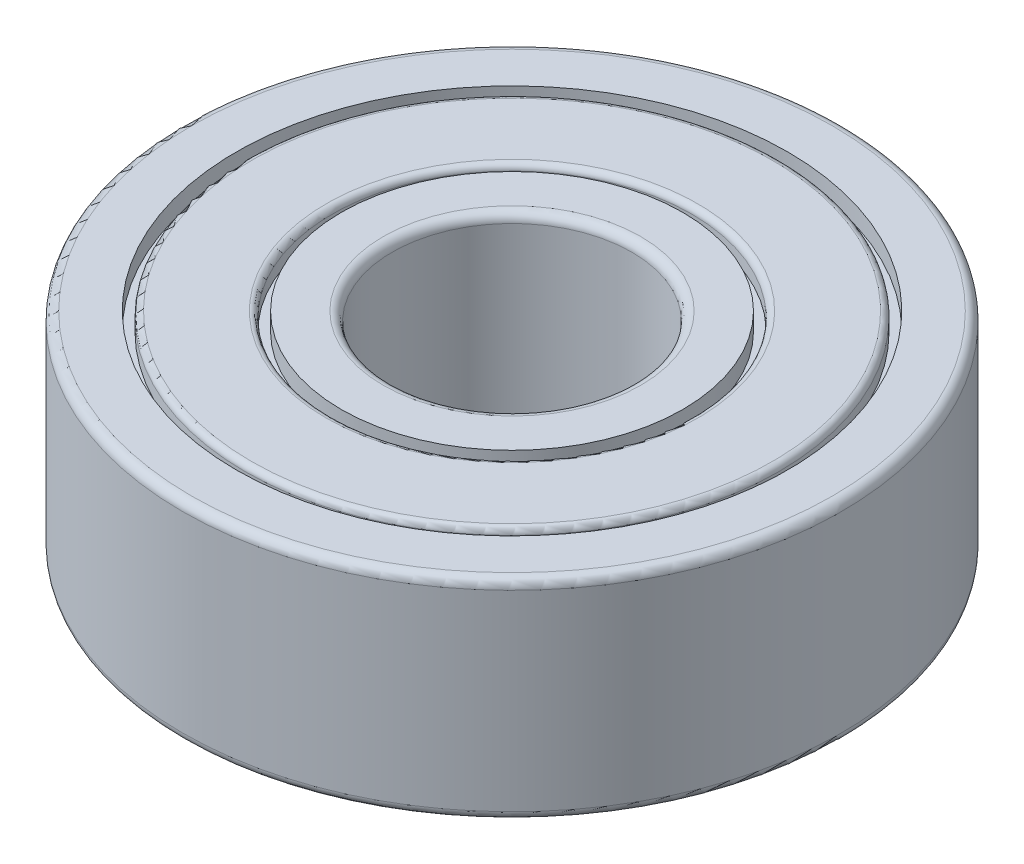
ISO-10303-21;
HEADER;
FILE_DESCRIPTION(('STEP AP214'),'2;1');
FILE_NAME('part.step','',(''),(''),'','','');
FILE_SCHEMA(('AUTOMOTIVE_DESIGN { 1 0 10303 214 1 1 1 1 }'));
ENDSEC;
DATA;
#1=APPLICATION_CONTEXT('core data for automotive mechanical design processes');
#2=APPLICATION_PROTOCOL_DEFINITION('international standard','automotive_design',2000,#1);
#3=PRODUCT_CONTEXT('',#1,'mechanical');
#4=PRODUCT('Part','Part','',(#3));
#5=PRODUCT_RELATED_PRODUCT_CATEGORY('part','',(#4));
#6=PRODUCT_DEFINITION_FORMATION('','',#4);
#7=PRODUCT_DEFINITION_CONTEXT('part definition',#1,'design');
#8=PRODUCT_DEFINITION('design','',#6,#7);
#9=PRODUCT_DEFINITION_SHAPE('','',#8);
#10=(LENGTH_UNIT() NAMED_UNIT(*) SI_UNIT(.MILLI.,.METRE.));
#11=(NAMED_UNIT(*) PLANE_ANGLE_UNIT() SI_UNIT($,.RADIAN.));
#12=(NAMED_UNIT(*) SI_UNIT($,.STERADIAN.) SOLID_ANGLE_UNIT());
#13=UNCERTAINTY_MEASURE_WITH_UNIT(LENGTH_MEASURE(1.E-05),#10,'distance_accuracy_value','');
#14=(GEOMETRIC_REPRESENTATION_CONTEXT(3) GLOBAL_UNCERTAINTY_ASSIGNED_CONTEXT((#13)) GLOBAL_UNIT_ASSIGNED_CONTEXT((#10,
#11,#12)) REPRESENTATION_CONTEXT('',''));
#15=CARTESIAN_POINT('',(0.,0.,0.));
#16=DIRECTION('',(0.,0.,1.));
#17=DIRECTION('',(1.,0.,0.));
#18=AXIS2_PLACEMENT_3D('',#15,#16,#17);
#19=CARTESIAN_POINT('',(0.,3.2,0.));
#20=DIRECTION('',(0.,-1.,0.));
#21=DIRECTION('',(0.,0.,-1.));
#22=AXIS2_PLACEMENT_3D('',#19,#20,#21);
#23=CYLINDRICAL_SURFACE('',#22,4.);
#24=CARTESIAN_POINT('',(0.,-3.2,0.));
#25=DIRECTION('',(0.,-1.,0.));
#26=DIRECTION('',(0.,0.,1.));
#27=AXIS2_PLACEMENT_3D('',#24,#25,#26);
#28=CIRCLE('',#27,4.);
#29=CARTESIAN_POINT('',(0.,-3.2,4.));
#30=VERTEX_POINT('',#29);
#31=EDGE_CURVE('E274',#30,#30,#28,.F.);
#32=ORIENTED_EDGE('',*,*,#31,.F.);
#33=EDGE_LOOP('',(#32));
#34=FACE_BOUND('',#33,.T.);
#35=CARTESIAN_POINT('',(0.,3.2,0.));
#36=DIRECTION('',(0.,-1.,0.));
#37=DIRECTION('',(0.,0.,1.));
#38=AXIS2_PLACEMENT_3D('',#35,#36,#37);
#39=CIRCLE('',#38,4.);
#40=CARTESIAN_POINT('',(0.,3.2,4.));
#41=VERTEX_POINT('',#40);
#42=EDGE_CURVE('E278',#41,#41,#39,.F.);
#43=ORIENTED_EDGE('',*,*,#42,.T.);
#44=EDGE_LOOP('',(#43));
#45=FACE_BOUND('',#44,.T.);
#46=ADVANCED_FACE('F14',(#34,#45),#23,.F.);
#47=CARTESIAN_POINT('',(0.,3.2,0.));
#48=DIRECTION('',(0.,-1.,0.));
#49=DIRECTION('',(0.,0.,1.));
#50=AXIS2_PLACEMENT_3D('',#47,#48,#49);
#51=TOROIDAL_SURFACE('',#50,4.3,0.3);
#52=ORIENTED_EDGE('',*,*,#42,.F.);
#53=EDGE_LOOP('',(#52));
#54=FACE_BOUND('',#53,.T.);
#55=CARTESIAN_POINT('',(0.,3.5,0.));
#56=DIRECTION('',(0.,1.,0.));
#57=DIRECTION('',(0.,0.,1.));
#58=AXIS2_PLACEMENT_3D('',#55,#56,#57);
#59=CIRCLE('',#58,4.3);
#60=CARTESIAN_POINT('',(0.,3.5,4.3));
#61=VERTEX_POINT('',#60);
#62=EDGE_CURVE('E277',#61,#61,#59,.F.);
#63=ORIENTED_EDGE('',*,*,#62,.F.);
#64=EDGE_LOOP('',(#63));
#65=FACE_BOUND('',#64,.T.);
#66=ADVANCED_FACE('F292',(#54,#65),#51,.T.);
#67=CARTESIAN_POINT('',(0.,-3.20000000000001,0.));
#68=DIRECTION('',(0.,-1.,0.));
#69=DIRECTION('',(0.,0.,1.));
#70=AXIS2_PLACEMENT_3D('',#67,#68,#69);
#71=TOROIDAL_SURFACE('',#70,4.3,0.3);
#72=CARTESIAN_POINT('',(0.,-3.5,0.));
#73=DIRECTION('',(0.,-1.,0.));
#74=DIRECTION('',(0.,0.,1.));
#75=AXIS2_PLACEMENT_3D('',#72,#73,#74);
#76=CIRCLE('',#75,4.3);
#77=CARTESIAN_POINT('',(0.,-3.5,4.3));
#78=VERTEX_POINT('',#77);
#79=EDGE_CURVE('E238',#78,#78,#76,.F.);
#80=ORIENTED_EDGE('',*,*,#79,.F.);
#81=EDGE_LOOP('',(#80));
#82=FACE_BOUND('',#81,.T.);
#83=ORIENTED_EDGE('',*,*,#31,.T.);
#84=EDGE_LOOP('',(#83));
#85=FACE_BOUND('',#84,.T.);
#86=ADVANCED_FACE('F261',(#82,#85),#71,.T.);
#87=CARTESIAN_POINT('',(0.,3.5,0.));
#88=DIRECTION('',(0.,1.,0.));
#89=DIRECTION('',(0.,0.,1.));
#90=AXIS2_PLACEMENT_3D('',#87,#88,#89);
#91=PLANE('',#90);
#92=ORIENTED_EDGE('',*,*,#62,.T.);
#93=EDGE_LOOP('',(#92));
#94=FACE_BOUND('',#93,.T.);
#95=CARTESIAN_POINT('',(0.,3.5,0.));
#96=DIRECTION('',(0.,1.,0.));
#97=DIRECTION('',(0.,0.,1.));
#98=AXIS2_PLACEMENT_3D('',#95,#96,#97);
#99=CIRCLE('',#98,5.7);
#100=CARTESIAN_POINT('',(0.,3.5,5.7));
#101=VERTEX_POINT('',#100);
#102=EDGE_CURVE('E17',#101,#101,#99,.F.);
#103=ORIENTED_EDGE('',*,*,#102,.F.);
#104=EDGE_LOOP('',(#103));
#105=FACE_BOUND('',#104,.T.);
#106=ADVANCED_FACE('F256',(#94,#105),#91,.T.);
#107=CARTESIAN_POINT('',(0.,-3.5,0.));
#108=DIRECTION('',(0.,-1.,0.));
#109=DIRECTION('',(0.,0.,-1.));
#110=AXIS2_PLACEMENT_3D('',#107,#108,#109);
#111=PLANE('',#110);
#112=ORIENTED_EDGE('',*,*,#79,.T.);
#113=EDGE_LOOP('',(#112));
#114=FACE_BOUND('',#113,.T.);
#115=CARTESIAN_POINT('',(0.,-3.50000000000001,0.));
#116=DIRECTION('',(0.,-1.,0.));
#117=DIRECTION('',(0.,0.,-1.));
#118=AXIS2_PLACEMENT_3D('',#115,#116,#117);
#119=CIRCLE('',#118,5.7);
#120=CARTESIAN_POINT('',(0.,-3.50000000000001,-5.7));
#121=VERTEX_POINT('',#120);
#122=EDGE_CURVE('E335',#121,#121,#119,.F.);
#123=ORIENTED_EDGE('',*,*,#122,.F.);
#124=EDGE_LOOP('',(#123));
#125=FACE_BOUND('',#124,.T.);
#126=ADVANCED_FACE('F245',(#114,#125),#111,.T.);
#127=CARTESIAN_POINT('',(0.,2.9,0.));
#128=DIRECTION('',(0.,1.,0.));
#129=DIRECTION('',(0.,0.,1.));
#130=AXIS2_PLACEMENT_3D('',#127,#128,#129);
#131=CYLINDRICAL_SURFACE('',#130,5.7);
#132=CARTESIAN_POINT('',(0.,2.9,0.));
#133=DIRECTION('',(0.,1.,0.));
#134=DIRECTION('',(0.,0.,1.));
#135=AXIS2_PLACEMENT_3D('',#132,#133,#134);
#136=CIRCLE('',#135,5.7);
#137=CARTESIAN_POINT('',(0.,2.9,5.7));
#138=VERTEX_POINT('',#137);
#139=EDGE_CURVE('E333',#138,#138,#136,.F.);
#140=ORIENTED_EDGE('',*,*,#139,.F.);
#141=EDGE_LOOP('',(#140));
#142=FACE_BOUND('',#141,.T.);
#143=ORIENTED_EDGE('',*,*,#102,.T.);
#144=EDGE_LOOP('',(#143));
#145=FACE_BOUND('',#144,.T.);
#146=ADVANCED_FACE('F255',(#142,#145),#131,.T.);
#147=CARTESIAN_POINT('',(0.,-2.9,0.));
#148=DIRECTION('',(0.,-1.,0.));
#149=DIRECTION('',(0.,0.,-1.));
#150=AXIS2_PLACEMENT_3D('',#147,#148,#149);
#151=CYLINDRICAL_SURFACE('',#150,5.7);
#152=ORIENTED_EDGE('',*,*,#122,.T.);
#153=EDGE_LOOP('',(#152));
#154=FACE_BOUND('',#153,.T.);
#155=CARTESIAN_POINT('',(0.,-2.90000000000001,0.));
#156=DIRECTION('',(0.,-1.,0.));
#157=DIRECTION('',(0.,0.,-1.));
#158=AXIS2_PLACEMENT_3D('',#155,#156,#157);
#159=CIRCLE('',#158,5.7);
#160=CARTESIAN_POINT('',(0.,-2.90000000000001,-5.7));
#161=VERTEX_POINT('',#160);
#162=EDGE_CURVE('E330',#161,#161,#159,.F.);
#163=ORIENTED_EDGE('',*,*,#162,.F.);
#164=EDGE_LOOP('',(#163));
#165=FACE_BOUND('',#164,.T.);
#166=ADVANCED_FACE('F345',(#154,#165),#151,.T.);
#167=CARTESIAN_POINT('',(0.,2.9,0.));
#168=DIRECTION('',(0.,1.,0.));
#169=DIRECTION('',(0.,0.,1.));
#170=AXIS2_PLACEMENT_3D('',#167,#168,#169);
#171=PLANE('',#170);
#172=ORIENTED_EDGE('',*,*,#139,.T.);
#173=EDGE_LOOP('',(#172));
#174=FACE_BOUND('',#173,.T.);
#175=CARTESIAN_POINT('',(0.,2.9,0.));
#176=DIRECTION('',(0.,-1.,0.));
#177=DIRECTION('',(0.,0.,-1.));
#178=AXIS2_PLACEMENT_3D('',#175,#176,#177);
#179=CIRCLE('',#178,6.);
#180=CARTESIAN_POINT('',(0.,2.89999999999999,-6.));
#181=VERTEX_POINT('',#180);
#182=EDGE_CURVE('E327',#181,#181,#179,.F.);
#183=ORIENTED_EDGE('',*,*,#182,.T.);
#184=EDGE_LOOP('',(#183));
#185=FACE_BOUND('',#184,.T.);
#186=ADVANCED_FACE('F351',(#174,#185),#171,.T.);
#187=CARTESIAN_POINT('',(0.,-2.9,0.));
#188=DIRECTION('',(0.,-1.,0.));
#189=DIRECTION('',(0.,0.,-1.));
#190=AXIS2_PLACEMENT_3D('',#187,#188,#189);
#191=PLANE('',#190);
#192=ORIENTED_EDGE('',*,*,#162,.T.);
#193=EDGE_LOOP('',(#192));
#194=FACE_BOUND('',#193,.T.);
#195=CARTESIAN_POINT('',(0.,-2.90000000000001,0.));
#196=DIRECTION('',(0.,1.,0.));
#197=DIRECTION('',(0.,0.,1.));
#198=AXIS2_PLACEMENT_3D('',#195,#196,#197);
#199=CIRCLE('',#198,6.);
#200=CARTESIAN_POINT('',(0.,-2.9,6.));
#201=VERTEX_POINT('',#200);
#202=EDGE_CURVE('E223',#201,#201,#199,.F.);
#203=ORIENTED_EDGE('',*,*,#202,.T.);
#204=EDGE_LOOP('',(#203));
#205=FACE_BOUND('',#204,.T.);
#206=ADVANCED_FACE('F451',(#194,#205),#191,.T.);
#207=CARTESIAN_POINT('',(0.,3.3,0.));
#208=DIRECTION('',(0.,-1.,0.));
#209=DIRECTION('',(0.,0.,-1.));
#210=AXIS2_PLACEMENT_3D('',#207,#208,#209);
#211=CYLINDRICAL_SURFACE('',#210,6.);
#212=CARTESIAN_POINT('',(0.,3.3,0.));
#213=DIRECTION('',(0.,-1.,0.));
#214=DIRECTION('',(0.,0.,1.));
#215=AXIS2_PLACEMENT_3D('',#212,#213,#214);
#216=CIRCLE('',#215,6.);
#217=CARTESIAN_POINT('',(0.,3.3,6.));
#218=VERTEX_POINT('',#217);
#219=EDGE_CURVE('E220',#218,#218,#216,.F.);
#220=ORIENTED_EDGE('',*,*,#219,.T.);
#221=EDGE_LOOP('',(#220));
#222=FACE_BOUND('',#221,.T.);
#223=ORIENTED_EDGE('',*,*,#182,.F.);
#224=EDGE_LOOP('',(#223));
#225=FACE_BOUND('',#224,.T.);
#226=ADVANCED_FACE('F444',(#222,#225),#211,.F.);
#227=CARTESIAN_POINT('',(0.,-3.3,0.));
#228=DIRECTION('',(0.,1.,0.));
#229=DIRECTION('',(0.,0.,1.));
#230=AXIS2_PLACEMENT_3D('',#227,#228,#229);
#231=CYLINDRICAL_SURFACE('',#230,6.);
#232=ORIENTED_EDGE('',*,*,#202,.F.);
#233=EDGE_LOOP('',(#232));
#234=FACE_BOUND('',#233,.T.);
#235=CARTESIAN_POINT('',(0.,-3.30000000000001,0.));
#236=DIRECTION('',(0.,-1.,0.));
#237=DIRECTION('',(0.,0.,1.));
#238=AXIS2_PLACEMENT_3D('',#235,#236,#237);
#239=CIRCLE('',#238,6.);
#240=CARTESIAN_POINT('',(0.,-3.3,6.));
#241=VERTEX_POINT('',#240);
#242=EDGE_CURVE('E198',#241,#241,#239,.F.);
#243=ORIENTED_EDGE('',*,*,#242,.F.);
#244=EDGE_LOOP('',(#243));
#245=FACE_BOUND('',#244,.T.);
#246=ADVANCED_FACE('F437',(#234,#245),#231,.F.);
#247=CARTESIAN_POINT('',(0.,3.3,0.));
#248=DIRECTION('',(0.,-1.,0.));
#249=DIRECTION('',(0.,0.,1.));
#250=AXIS2_PLACEMENT_3D('',#247,#248,#249);
#251=TOROIDAL_SURFACE('',#250,6.2,0.2);
#252=ORIENTED_EDGE('',*,*,#219,.F.);
#253=EDGE_LOOP('',(#252));
#254=FACE_BOUND('',#253,.T.);
#255=CARTESIAN_POINT('',(0.,3.5,0.));
#256=DIRECTION('',(0.,1.,0.));
#257=DIRECTION('',(0.,0.,1.));
#258=AXIS2_PLACEMENT_3D('',#255,#256,#257);
#259=CIRCLE('',#258,6.2);
#260=CARTESIAN_POINT('',(0.,3.5,6.2));
#261=VERTEX_POINT('',#260);
#262=EDGE_CURVE('E177',#261,#261,#259,.F.);
#263=ORIENTED_EDGE('',*,*,#262,.F.);
#264=EDGE_LOOP('',(#263));
#265=FACE_BOUND('',#264,.T.);
#266=ADVANCED_FACE('F204',(#254,#265),#251,.T.);
#267=CARTESIAN_POINT('',(0.,-3.30000000000001,0.));
#268=DIRECTION('',(0.,-1.,0.));
#269=DIRECTION('',(0.,0.,1.));
#270=AXIS2_PLACEMENT_3D('',#267,#268,#269);
#271=TOROIDAL_SURFACE('',#270,6.2,0.2);
#272=CARTESIAN_POINT('',(0.,-3.50000000000001,0.));
#273=DIRECTION('',(0.,-1.,0.));
#274=DIRECTION('',(0.,0.,1.));
#275=AXIS2_PLACEMENT_3D('',#272,#273,#274);
#276=CIRCLE('',#275,6.2);
#277=CARTESIAN_POINT('',(0.,-3.5,6.2));
#278=VERTEX_POINT('',#277);
#279=EDGE_CURVE('E582',#278,#278,#276,.F.);
#280=ORIENTED_EDGE('',*,*,#279,.F.);
#281=EDGE_LOOP('',(#280));
#282=FACE_BOUND('',#281,.T.);
#283=ORIENTED_EDGE('',*,*,#242,.T.);
#284=EDGE_LOOP('',(#283));
#285=FACE_BOUND('',#284,.T.);
#286=ADVANCED_FACE('F200',(#282,#285),#271,.T.);
#287=CARTESIAN_POINT('',(0.,3.5,0.));
#288=DIRECTION('',(0.,1.,0.));
#289=DIRECTION('',(0.,0.,1.));
#290=AXIS2_PLACEMENT_3D('',#287,#288,#289);
#291=PLANE('',#290);
#292=ORIENTED_EDGE('',*,*,#262,.T.);
#293=EDGE_LOOP('',(#292));
#294=FACE_BOUND('',#293,.T.);
#295=CARTESIAN_POINT('',(0.,3.5,0.));
#296=DIRECTION('',(0.,-1.,0.));
#297=DIRECTION('',(0.,0.,1.));
#298=AXIS2_PLACEMENT_3D('',#295,#296,#297);
#299=CIRCLE('',#298,8.7);
#300=CARTESIAN_POINT('',(0.,3.5,8.7));
#301=VERTEX_POINT('',#300);
#302=EDGE_CURVE('E164',#301,#301,#299,.F.);
#303=ORIENTED_EDGE('',*,*,#302,.T.);
#304=EDGE_LOOP('',(#303));
#305=FACE_BOUND('',#304,.T.);
#306=ADVANCED_FACE('F138',(#294,#305),#291,.T.);
#307=CARTESIAN_POINT('',(0.,-3.5,0.));
#308=DIRECTION('',(0.,-1.,0.));
#309=DIRECTION('',(0.,0.,-1.));
#310=AXIS2_PLACEMENT_3D('',#307,#308,#309);
#311=PLANE('',#310);
#312=ORIENTED_EDGE('',*,*,#279,.T.);
#313=EDGE_LOOP('',(#312));
#314=FACE_BOUND('',#313,.T.);
#315=CARTESIAN_POINT('',(0.,-3.50000000000001,0.));
#316=DIRECTION('',(0.,1.,0.));
#317=DIRECTION('',(0.,0.,1.));
#318=AXIS2_PLACEMENT_3D('',#315,#316,#317);
#319=CIRCLE('',#318,8.7);
#320=CARTESIAN_POINT('',(0.,-3.5,8.7));
#321=VERTEX_POINT('',#320);
#322=EDGE_CURVE('E123',#321,#321,#319,.T.);
#323=ORIENTED_EDGE('',*,*,#322,.F.);
#324=EDGE_LOOP('',(#323));
#325=FACE_BOUND('',#324,.T.);
#326=ADVANCED_FACE('F129',(#314,#325),#311,.T.);
#327=CARTESIAN_POINT('',(0.,3.3,0.));
#328=DIRECTION('',(0.,-1.,0.));
#329=DIRECTION('',(0.,0.,1.));
#330=AXIS2_PLACEMENT_3D('',#327,#328,#329);
#331=TOROIDAL_SURFACE('',#330,8.7,0.2);
#332=ORIENTED_EDGE('',*,*,#302,.F.);
#333=EDGE_LOOP('',(#332));
#334=FACE_BOUND('',#333,.T.);
#335=CARTESIAN_POINT('',(0.,3.29999999999999,0.));
#336=DIRECTION('',(0.,1.,0.));
#337=DIRECTION('',(0.,0.,1.));
#338=AXIS2_PLACEMENT_3D('',#335,#336,#337);
#339=CIRCLE('',#338,8.9);
#340=CARTESIAN_POINT('',(0.,3.3,8.9));
#341=VERTEX_POINT('',#340);
#342=EDGE_CURVE('E115',#341,#341,#339,.F.);
#343=ORIENTED_EDGE('',*,*,#342,.F.);
#344=EDGE_LOOP('',(#343));
#345=FACE_BOUND('',#344,.T.);
#346=ADVANCED_FACE('F107',(#334,#345),#331,.T.);
#347=CARTESIAN_POINT('',(0.,-3.30000000000001,0.));
#348=DIRECTION('',(0.,-1.,0.));
#349=DIRECTION('',(0.,0.,1.));
#350=AXIS2_PLACEMENT_3D('',#347,#348,#349);
#351=TOROIDAL_SURFACE('',#350,8.7,0.2);
#352=CARTESIAN_POINT('',(0.,-3.30000000000001,0.));
#353=DIRECTION('',(0.,-1.,0.));
#354=DIRECTION('',(0.,0.,-1.));
#355=AXIS2_PLACEMENT_3D('',#352,#353,#354);
#356=CIRCLE('',#355,8.9);
#357=CARTESIAN_POINT('',(0.,-3.30000000000002,-8.9));
#358=VERTEX_POINT('',#357);
#359=EDGE_CURVE('E324',#358,#358,#356,.F.);
#360=ORIENTED_EDGE('',*,*,#359,.F.);
#361=EDGE_LOOP('',(#360));
#362=FACE_BOUND('',#361,.T.);
#363=ORIENTED_EDGE('',*,*,#322,.T.);
#364=EDGE_LOOP('',(#363));
#365=FACE_BOUND('',#364,.T.);
#366=ADVANCED_FACE('F101',(#362,#365),#351,.T.);
#367=CARTESIAN_POINT('',(0.,2.9,0.));
#368=DIRECTION('',(0.,1.,0.));
#369=DIRECTION('',(0.,0.,1.));
#370=AXIS2_PLACEMENT_3D('',#367,#368,#369);
#371=CYLINDRICAL_SURFACE('',#370,8.9);
#372=CARTESIAN_POINT('',(0.,2.9,0.));
#373=DIRECTION('',(0.,1.,0.));
#374=DIRECTION('',(0.,0.,1.));
#375=AXIS2_PLACEMENT_3D('',#372,#373,#374);
#376=CIRCLE('',#375,8.9);
#377=CARTESIAN_POINT('',(0.,2.9,8.9));
#378=VERTEX_POINT('',#377);
#379=EDGE_CURVE('E321',#378,#378,#376,.F.);
#380=ORIENTED_EDGE('',*,*,#379,.F.);
#381=EDGE_LOOP('',(#380));
#382=FACE_BOUND('',#381,.T.);
#383=ORIENTED_EDGE('',*,*,#342,.T.);
#384=EDGE_LOOP('',(#383));
#385=FACE_BOUND('',#384,.T.);
#386=ADVANCED_FACE('F97',(#382,#385),#371,.T.);
#387=CARTESIAN_POINT('',(0.,-2.9,0.));
#388=DIRECTION('',(0.,-1.,0.));
#389=DIRECTION('',(0.,0.,-1.));
#390=AXIS2_PLACEMENT_3D('',#387,#388,#389);
#391=CYLINDRICAL_SURFACE('',#390,8.9);
#392=ORIENTED_EDGE('',*,*,#359,.T.);
#393=EDGE_LOOP('',(#392));
#394=FACE_BOUND('',#393,.T.);
#395=CARTESIAN_POINT('',(0.,-2.90000000000001,0.));
#396=DIRECTION('',(0.,-1.,0.));
#397=DIRECTION('',(0.,0.,-1.));
#398=AXIS2_PLACEMENT_3D('',#395,#396,#397);
#399=CIRCLE('',#398,8.9);
#400=CARTESIAN_POINT('',(0.,-2.90000000000002,-8.9));
#401=VERTEX_POINT('',#400);
#402=EDGE_CURVE('E318',#401,#401,#399,.F.);
#403=ORIENTED_EDGE('',*,*,#402,.F.);
#404=EDGE_LOOP('',(#403));
#405=FACE_BOUND('',#404,.T.);
#406=ADVANCED_FACE('F93',(#394,#405),#391,.T.);
#407=CARTESIAN_POINT('',(0.,2.9,0.));
#408=DIRECTION('',(0.,1.,0.));
#409=DIRECTION('',(0.,0.,1.));
#410=AXIS2_PLACEMENT_3D('',#407,#408,#409);
#411=PLANE('',#410);
#412=ORIENTED_EDGE('',*,*,#379,.T.);
#413=EDGE_LOOP('',(#412));
#414=FACE_BOUND('',#413,.T.);
#415=CARTESIAN_POINT('',(0.,2.89999999999999,0.));
#416=DIRECTION('',(0.,-1.,0.));
#417=DIRECTION('',(0.,0.,-1.));
#418=AXIS2_PLACEMENT_3D('',#415,#416,#417);
#419=CIRCLE('',#418,9.2);
#420=CARTESIAN_POINT('',(0.,2.89999999999999,-9.2));
#421=VERTEX_POINT('',#420);
#422=EDGE_CURVE('E315',#421,#421,#419,.F.);
#423=ORIENTED_EDGE('',*,*,#422,.T.);
#424=EDGE_LOOP('',(#423));
#425=FACE_BOUND('',#424,.T.);
#426=ADVANCED_FACE('F89',(#414,#425),#411,.T.);
#427=CARTESIAN_POINT('',(0.,-2.9,0.));
#428=DIRECTION('',(0.,-1.,0.));
#429=DIRECTION('',(0.,0.,-1.));
#430=AXIS2_PLACEMENT_3D('',#427,#428,#429);
#431=PLANE('',#430);
#432=ORIENTED_EDGE('',*,*,#402,.T.);
#433=EDGE_LOOP('',(#432));
#434=FACE_BOUND('',#433,.T.);
#435=CARTESIAN_POINT('',(0.,-2.90000000000001,0.));
#436=DIRECTION('',(0.,1.,0.));
#437=DIRECTION('',(0.,0.,1.));
#438=AXIS2_PLACEMENT_3D('',#435,#436,#437);
#439=CIRCLE('',#438,9.2);
#440=CARTESIAN_POINT('',(0.,-2.9,9.2));
#441=VERTEX_POINT('',#440);
#442=EDGE_CURVE('E312',#441,#441,#439,.F.);
#443=ORIENTED_EDGE('',*,*,#442,.T.);
#444=EDGE_LOOP('',(#443));
#445=FACE_BOUND('',#444,.T.);
#446=ADVANCED_FACE('F85',(#434,#445),#431,.T.);
#447=CARTESIAN_POINT('',(0.,3.5,0.));
#448=DIRECTION('',(0.,-1.,0.));
#449=DIRECTION('',(0.,0.,-1.));
#450=AXIS2_PLACEMENT_3D('',#447,#448,#449);
#451=CYLINDRICAL_SURFACE('',#450,9.2);
#452=CARTESIAN_POINT('',(0.,3.49999999999999,0.));
#453=DIRECTION('',(0.,-1.,0.));
#454=DIRECTION('',(0.,0.,-1.));
#455=AXIS2_PLACEMENT_3D('',#452,#453,#454);
#456=CIRCLE('',#455,9.2);
#457=CARTESIAN_POINT('',(0.,3.49999999999999,-9.2));
#458=VERTEX_POINT('',#457);
#459=EDGE_CURVE('E309',#458,#458,#456,.T.);
#460=ORIENTED_EDGE('',*,*,#459,.F.);
#461=EDGE_LOOP('',(#460));
#462=FACE_BOUND('',#461,.T.);
#463=ORIENTED_EDGE('',*,*,#422,.F.);
#464=EDGE_LOOP('',(#463));
#465=FACE_BOUND('',#464,.T.);
#466=ADVANCED_FACE('F81',(#462,#465),#451,.F.);
#467=CARTESIAN_POINT('',(0.,-3.5,0.));
#468=DIRECTION('',(0.,1.,0.));
#469=DIRECTION('',(0.,0.,1.));
#470=AXIS2_PLACEMENT_3D('',#467,#468,#469);
#471=CYLINDRICAL_SURFACE('',#470,9.2);
#472=ORIENTED_EDGE('',*,*,#442,.F.);
#473=EDGE_LOOP('',(#472));
#474=FACE_BOUND('',#473,.T.);
#475=CARTESIAN_POINT('',(0.,-3.50000000000001,0.));
#476=DIRECTION('',(0.,1.,0.));
#477=DIRECTION('',(0.,0.,1.));
#478=AXIS2_PLACEMENT_3D('',#475,#476,#477);
#479=CIRCLE('',#478,9.2);
#480=CARTESIAN_POINT('',(0.,-3.5,9.2));
#481=VERTEX_POINT('',#480);
#482=EDGE_CURVE('E301',#481,#481,#479,.T.);
#483=ORIENTED_EDGE('',*,*,#482,.F.);
#484=EDGE_LOOP('',(#483));
#485=FACE_BOUND('',#484,.T.);
#486=ADVANCED_FACE('F76',(#474,#485),#471,.F.);
#487=CARTESIAN_POINT('',(0.,3.5,0.));
#488=DIRECTION('',(0.,1.,0.));
#489=DIRECTION('',(0.,0.,1.));
#490=AXIS2_PLACEMENT_3D('',#487,#488,#489);
#491=PLANE('',#490);
#492=ORIENTED_EDGE('',*,*,#459,.T.);
#493=EDGE_LOOP('',(#492));
#494=FACE_BOUND('',#493,.T.);
#495=CARTESIAN_POINT('',(0.,3.49999999999999,0.));
#496=DIRECTION('',(0.,-1.,0.));
#497=DIRECTION('',(0.,0.,1.));
#498=AXIS2_PLACEMENT_3D('',#495,#496,#497);
#499=CIRCLE('',#498,10.7);
#500=CARTESIAN_POINT('',(0.,3.5,10.7));
#501=VERTEX_POINT('',#500);
#502=EDGE_CURVE('E60',#501,#501,#499,.F.);
#503=ORIENTED_EDGE('',*,*,#502,.T.);
#504=EDGE_LOOP('',(#503));
#505=FACE_BOUND('',#504,.T.);
#506=ADVANCED_FACE('F66',(#494,#505),#491,.T.);
#507=CARTESIAN_POINT('',(0.,-3.5,0.));
#508=DIRECTION('',(0.,-1.,0.));
#509=DIRECTION('',(0.,0.,-1.));
#510=AXIS2_PLACEMENT_3D('',#507,#508,#509);
#511=PLANE('',#510);
#512=ORIENTED_EDGE('',*,*,#482,.T.);
#513=EDGE_LOOP('',(#512));
#514=FACE_BOUND('',#513,.T.);
#515=CARTESIAN_POINT('',(0.,-3.50000000000001,0.));
#516=DIRECTION('',(0.,1.,0.));
#517=DIRECTION('',(0.,0.,1.));
#518=AXIS2_PLACEMENT_3D('',#515,#516,#517);
#519=CIRCLE('',#518,10.7);
#520=CARTESIAN_POINT('',(0.,-3.5,10.7));
#521=VERTEX_POINT('',#520);
#522=EDGE_CURVE('E26',#521,#521,#519,.T.);
#523=ORIENTED_EDGE('',*,*,#522,.F.);
#524=EDGE_LOOP('',(#523));
#525=FACE_BOUND('',#524,.T.);
#526=ADVANCED_FACE('F75',(#514,#525),#511,.T.);
#527=CARTESIAN_POINT('',(0.,3.19999999999999,0.));
#528=DIRECTION('',(0.,-1.,0.));
#529=DIRECTION('',(0.,0.,1.));
#530=AXIS2_PLACEMENT_3D('',#527,#528,#529);
#531=TOROIDAL_SURFACE('',#530,10.7,0.3);
#532=ORIENTED_EDGE('',*,*,#502,.F.);
#533=EDGE_LOOP('',(#532));
#534=FACE_BOUND('',#533,.T.);
#535=CARTESIAN_POINT('',(0.,3.19999999999999,0.));
#536=DIRECTION('',(0.,1.,0.));
#537=DIRECTION('',(0.,0.,1.));
#538=AXIS2_PLACEMENT_3D('',#535,#536,#537);
#539=CIRCLE('',#538,11.);
#540=CARTESIAN_POINT('',(0.,3.2,11.));
#541=VERTEX_POINT('',#540);
#542=EDGE_CURVE('E21',#541,#541,#539,.F.);
#543=ORIENTED_EDGE('',*,*,#542,.F.);
#544=EDGE_LOOP('',(#543));
#545=FACE_BOUND('',#544,.T.);
#546=ADVANCED_FACE('F40',(#534,#545),#531,.T.);
#547=CARTESIAN_POINT('',(0.,-3.20000000000001,0.));
#548=DIRECTION('',(0.,-1.,0.));
#549=DIRECTION('',(0.,0.,1.));
#550=AXIS2_PLACEMENT_3D('',#547,#548,#549);
#551=TOROIDAL_SURFACE('',#550,10.7,0.3);
#552=CARTESIAN_POINT('',(0.,-3.20000000000001,0.));
#553=DIRECTION('',(0.,1.,0.));
#554=DIRECTION('',(0.,0.,1.));
#555=AXIS2_PLACEMENT_3D('',#552,#553,#554);
#556=CIRCLE('',#555,11.);
#557=CARTESIAN_POINT('',(0.,-3.2,11.));
#558=VERTEX_POINT('',#557);
#559=EDGE_CURVE('E10',#558,#558,#556,.T.);
#560=ORIENTED_EDGE('',*,*,#559,.F.);
#561=EDGE_LOOP('',(#560));
#562=FACE_BOUND('',#561,.T.);
#563=ORIENTED_EDGE('',*,*,#522,.T.);
#564=EDGE_LOOP('',(#563));
#565=FACE_BOUND('',#564,.T.);
#566=ADVANCED_FACE('F34',(#562,#565),#551,.T.);
#567=CARTESIAN_POINT('',(0.,0.,0.));
#568=DIRECTION('',(0.,1.,0.));
#569=DIRECTION('',(0.,0.,1.));
#570=AXIS2_PLACEMENT_3D('',#567,#568,#569);
#571=CYLINDRICAL_SURFACE('',#570,11.);
#572=ORIENTED_EDGE('',*,*,#559,.T.);
#573=EDGE_LOOP('',(#572));
#574=FACE_BOUND('',#573,.T.);
#575=ORIENTED_EDGE('',*,*,#542,.T.);
#576=EDGE_LOOP('',(#575));
#577=FACE_BOUND('',#576,.T.);
#578=ADVANCED_FACE('F39',(#574,#577),#571,.T.);
#579=CLOSED_SHELL('',(#46,#66,#86,#106,#126,#146,#166,#186,#206,#226,#246,#266,#286,#306,#326,
#346,#366,#386,#406,#426,#446,#466,#486,#506,#526,#546,#566,#578));
#580=MANIFOLD_SOLID_BREP('B1',#579);
#581=ADVANCED_BREP_SHAPE_REPRESENTATION('',(#18,#580),#14);
#582=SHAPE_DEFINITION_REPRESENTATION(#9,#581);
ENDSEC;
END-ISO-10303-21;
